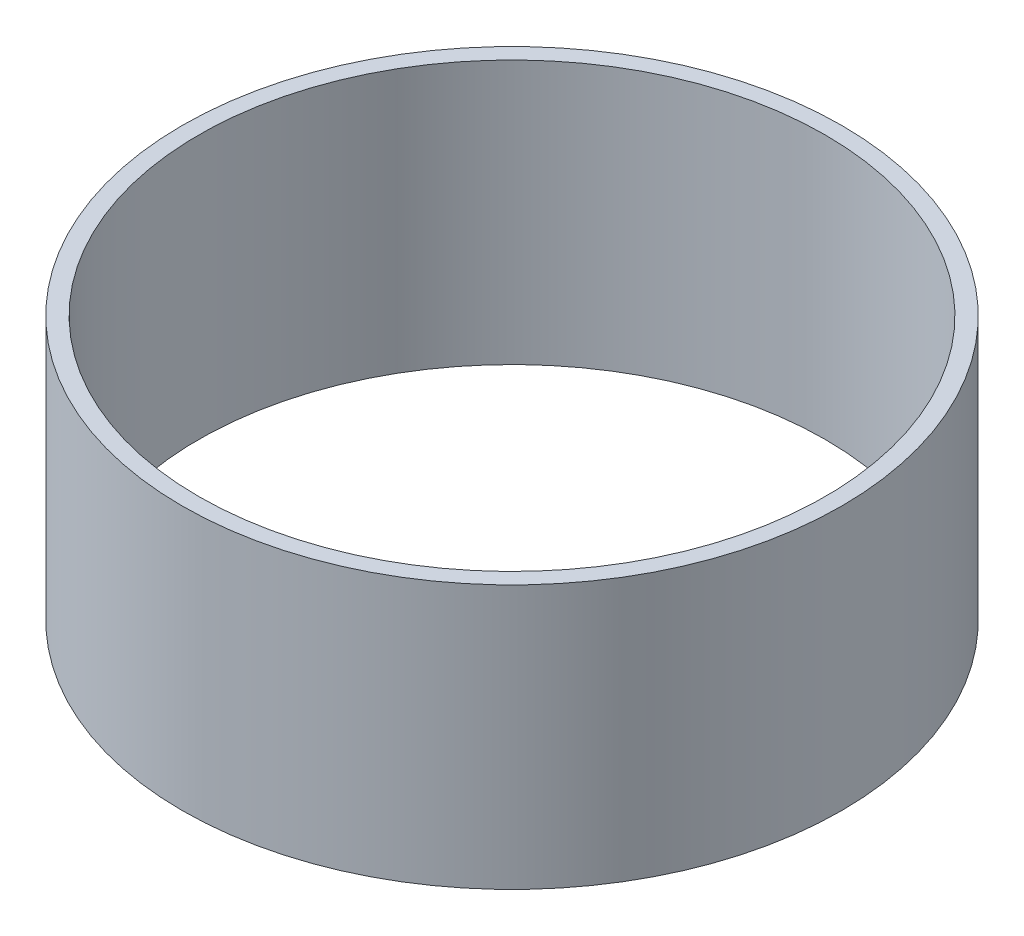
ISO-10303-21;
HEADER;
FILE_DESCRIPTION(('STEP AP214'),'2;1');
FILE_NAME('part.step','',(''),(''),'','','');
FILE_SCHEMA(('AUTOMOTIVE_DESIGN { 1 0 10303 214 1 1 1 1 }'));
ENDSEC;
DATA;
#1=APPLICATION_CONTEXT('core data for automotive mechanical design processes');
#2=APPLICATION_PROTOCOL_DEFINITION('international standard','automotive_design',2000,#1);
#3=PRODUCT_CONTEXT('',#1,'mechanical');
#4=PRODUCT('Part','Part','',(#3));
#5=PRODUCT_RELATED_PRODUCT_CATEGORY('part','',(#4));
#6=PRODUCT_DEFINITION_FORMATION('','',#4);
#7=PRODUCT_DEFINITION_CONTEXT('part definition',#1,'design');
#8=PRODUCT_DEFINITION('design','',#6,#7);
#9=PRODUCT_DEFINITION_SHAPE('','',#8);
#10=(LENGTH_UNIT() NAMED_UNIT(*) SI_UNIT(.MILLI.,.METRE.));
#11=(NAMED_UNIT(*) PLANE_ANGLE_UNIT() SI_UNIT($,.RADIAN.));
#12=(NAMED_UNIT(*) SI_UNIT($,.STERADIAN.) SOLID_ANGLE_UNIT());
#13=UNCERTAINTY_MEASURE_WITH_UNIT(LENGTH_MEASURE(1.E-05),#10,'distance_accuracy_value','');
#14=(GEOMETRIC_REPRESENTATION_CONTEXT(3) GLOBAL_UNCERTAINTY_ASSIGNED_CONTEXT((#13)) GLOBAL_UNIT_ASSIGNED_CONTEXT((#10,
#11,#12)) REPRESENTATION_CONTEXT('',''));
#15=CARTESIAN_POINT('',(0.,0.,0.));
#16=DIRECTION('',(0.,0.,1.));
#17=DIRECTION('',(1.,0.,0.));
#18=AXIS2_PLACEMENT_3D('',#15,#16,#17);
#19=CARTESIAN_POINT('',(0.,560.,0.));
#20=DIRECTION('',(0.,-1.,0.));
#21=DIRECTION('',(0.,0.,-1.));
#22=AXIS2_PLACEMENT_3D('',#19,#20,#21);
#23=CYLINDRICAL_SURFACE('',#22,700.);
#24=CARTESIAN_POINT('',(0.,560.,0.));
#25=DIRECTION('',(0.,1.,0.));
#26=DIRECTION('',(0.,0.,1.));
#27=AXIS2_PLACEMENT_3D('',#24,#25,#26);
#28=CIRCLE('',#27,700.);
#29=CARTESIAN_POINT('',(0.,560.,700.));
#30=VERTEX_POINT('',#29);
#31=EDGE_CURVE('E10',#30,#30,#28,.T.);
#32=ORIENTED_EDGE('',*,*,#31,.F.);
#33=EDGE_LOOP('',(#32));
#34=FACE_BOUND('',#33,.T.);
#35=CARTESIAN_POINT('',(0.,0.,0.));
#36=DIRECTION('',(0.,1.,0.));
#37=DIRECTION('',(0.,0.,1.));
#38=AXIS2_PLACEMENT_3D('',#35,#36,#37);
#39=CIRCLE('',#38,700.);
#40=CARTESIAN_POINT('',(0.,0.,700.));
#41=VERTEX_POINT('',#40);
#42=EDGE_CURVE('E34',#41,#41,#39,.T.);
#43=ORIENTED_EDGE('',*,*,#42,.T.);
#44=EDGE_LOOP('',(#43));
#45=FACE_BOUND('',#44,.T.);
#46=ADVANCED_FACE('F31',(#34,#45),#23,.T.);
#47=CARTESIAN_POINT('',(0.,560.,0.));
#48=DIRECTION('',(0.,1.,0.));
#49=DIRECTION('',(0.,0.,1.));
#50=AXIS2_PLACEMENT_3D('',#47,#48,#49);
#51=PLANE('',#50);
#52=CARTESIAN_POINT('',(0.,560.,0.));
#53=DIRECTION('',(0.,1.,0.));
#54=DIRECTION('',(0.,0.,1.));
#55=AXIS2_PLACEMENT_3D('',#52,#53,#54);
#56=CIRCLE('',#55,665.);
#57=CARTESIAN_POINT('',(0.,560.,665.));
#58=VERTEX_POINT('',#57);
#59=EDGE_CURVE('E43',#58,#58,#56,.T.);
#60=ORIENTED_EDGE('',*,*,#59,.F.);
#61=EDGE_LOOP('',(#60));
#62=FACE_BOUND('',#61,.T.);
#63=ORIENTED_EDGE('',*,*,#31,.T.);
#64=EDGE_LOOP('',(#63));
#65=FACE_BOUND('',#64,.T.);
#66=ADVANCED_FACE('F58',(#62,#65),#51,.T.);
#67=CARTESIAN_POINT('',(0.,0.,0.));
#68=DIRECTION('',(0.,1.,0.));
#69=DIRECTION('',(0.,0.,1.));
#70=AXIS2_PLACEMENT_3D('',#67,#68,#69);
#71=PLANE('',#70);
#72=CARTESIAN_POINT('',(0.,0.,0.));
#73=DIRECTION('',(0.,1.,0.));
#74=DIRECTION('',(0.,0.,1.));
#75=AXIS2_PLACEMENT_3D('',#72,#73,#74);
#76=CIRCLE('',#75,665.);
#77=CARTESIAN_POINT('',(0.,0.,665.));
#78=VERTEX_POINT('',#77);
#79=EDGE_CURVE('E41',#78,#78,#76,.T.);
#80=ORIENTED_EDGE('',*,*,#79,.T.);
#81=EDGE_LOOP('',(#80));
#82=FACE_BOUND('',#81,.T.);
#83=ORIENTED_EDGE('',*,*,#42,.F.);
#84=EDGE_LOOP('',(#83));
#85=FACE_BOUND('',#84,.T.);
#86=ADVANCED_FACE('F49',(#82,#85),#71,.F.);
#87=CARTESIAN_POINT('',(0.,0.,0.));
#88=DIRECTION('',(0.,1.,0.));
#89=DIRECTION('',(0.,0.,1.));
#90=AXIS2_PLACEMENT_3D('',#87,#88,#89);
#91=CYLINDRICAL_SURFACE('',#90,665.);
#92=ORIENTED_EDGE('',*,*,#79,.F.);
#93=EDGE_LOOP('',(#92));
#94=FACE_BOUND('',#93,.T.);
#95=ORIENTED_EDGE('',*,*,#59,.T.);
#96=EDGE_LOOP('',(#95));
#97=FACE_BOUND('',#96,.T.);
#98=ADVANCED_FACE('F52',(#94,#97),#91,.F.);
#99=CLOSED_SHELL('',(#46,#66,#86,#98));
#100=MANIFOLD_SOLID_BREP('B2',#99);
#101=ADVANCED_BREP_SHAPE_REPRESENTATION('',(#18,#100),#14);
#102=SHAPE_DEFINITION_REPRESENTATION(#9,#101);
ENDSEC;
END-ISO-10303-21;
